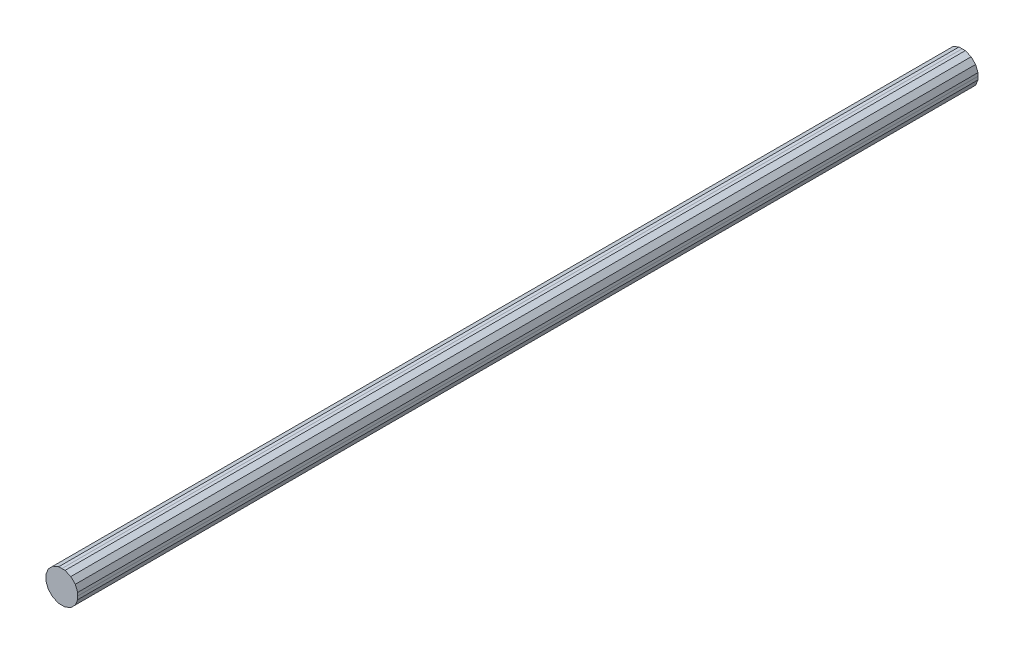
ISO-10303-21;
HEADER;
FILE_DESCRIPTION(('STEP AP214'),'2;1');
FILE_NAME('part.step','',(''),(''),'','','');
FILE_SCHEMA(('AUTOMOTIVE_DESIGN { 1 0 10303 214 1 1 1 1 }'));
ENDSEC;
DATA;
#1=APPLICATION_CONTEXT('core data for automotive mechanical design processes');
#2=APPLICATION_PROTOCOL_DEFINITION('international standard','automotive_design',2000,#1);
#3=PRODUCT_CONTEXT('',#1,'mechanical');
#4=PRODUCT('Part','Part','',(#3));
#5=PRODUCT_RELATED_PRODUCT_CATEGORY('part','',(#4));
#6=PRODUCT_DEFINITION_FORMATION('','',#4);
#7=PRODUCT_DEFINITION_CONTEXT('part definition',#1,'design');
#8=PRODUCT_DEFINITION('design','',#6,#7);
#9=PRODUCT_DEFINITION_SHAPE('','',#8);
#10=(LENGTH_UNIT() NAMED_UNIT(*) SI_UNIT(.MILLI.,.METRE.));
#11=(NAMED_UNIT(*) PLANE_ANGLE_UNIT() SI_UNIT($,.RADIAN.));
#12=(NAMED_UNIT(*) SI_UNIT($,.STERADIAN.) SOLID_ANGLE_UNIT());
#13=UNCERTAINTY_MEASURE_WITH_UNIT(LENGTH_MEASURE(1.E-05),#10,'distance_accuracy_value','');
#14=(GEOMETRIC_REPRESENTATION_CONTEXT(3) GLOBAL_UNCERTAINTY_ASSIGNED_CONTEXT((#13)) GLOBAL_UNIT_ASSIGNED_CONTEXT((#10,
#11,#12)) REPRESENTATION_CONTEXT('',''));
#15=CARTESIAN_POINT('',(0.,0.,0.));
#16=DIRECTION('',(0.,0.,1.));
#17=DIRECTION('',(1.,0.,0.));
#18=AXIS2_PLACEMENT_3D('',#15,#16,#17);
#19=CARTESIAN_POINT('',(0.,-0.2994914,16.99999902));
#20=DIRECTION('',(0.,0.,1.));
#21=DIRECTION('',(1.,0.,0.));
#22=AXIS2_PLACEMENT_3D('',#19,#20,#21);
#23=PLANE('',#22);
#24=DIRECTION('',(-1.,0.,0.));
#25=VECTOR('',#24,1.);
#26=CARTESIAN_POINT('',(0.05957062,-0.2994914,16.99999902));
#27=LINE('',#26,#25);
#28=CARTESIAN_POINT('',(0.05957062,-0.2994914,16.99999902));
#29=VERTEX_POINT('',#28);
#30=CARTESIAN_POINT('',(0.,-0.2994914,16.99999902));
#31=VERTEX_POINT('',#30);
#32=EDGE_CURVE('E27',#29,#31,#27,.T.);
#33=ORIENTED_EDGE('',*,*,#32,.F.);
#34=DIRECTION('',(-0.923885359866117,-0.382669363583048,0.));
#35=VECTOR('',#34,1.);
#36=CARTESIAN_POINT('',(0.1696466,-0.2538984,16.99999902));
#37=LINE('',#36,#35);
#38=CARTESIAN_POINT('',(0.1696466,-0.2538984,16.99999902));
#39=VERTEX_POINT('',#38);
#40=EDGE_CURVE('E403',#39,#29,#37,.T.);
#41=ORIENTED_EDGE('',*,*,#40,.F.);
#42=DIRECTION('',(-0.707106781187048,-0.707106781186048,0.));
#43=VECTOR('',#42,1.);
#44=CARTESIAN_POINT('',(0.25389586,-0.16964914,16.99999902));
#45=LINE('',#44,#43);
#46=CARTESIAN_POINT('',(0.25389586,-0.16964914,16.99999902));
#47=VERTEX_POINT('',#46);
#48=EDGE_CURVE('E305',#47,#39,#45,.T.);
#49=ORIENTED_EDGE('',*,*,#48,.F.);
#50=DIRECTION('',(-0.382687560176932,-0.923877822704835,0.));
#51=VECTOR('',#50,1.);
#52=CARTESIAN_POINT('',(0.2994914,-0.05957316000001,16.99999902));
#53=LINE('',#52,#51);
#54=CARTESIAN_POINT('',(0.2994914,-0.05957316000001,16.99999902));
#55=VERTEX_POINT('',#54);
#56=EDGE_CURVE('E124',#55,#47,#53,.T.);
#57=ORIENTED_EDGE('',*,*,#56,.F.);
#58=DIRECTION('',(0.,-1.,0.));
#59=VECTOR('',#58,1.);
#60=CARTESIAN_POINT('',(0.2994914,0.,16.99999902));
#61=LINE('',#60,#59);
#62=CARTESIAN_POINT('',(0.2994914,0.,16.99999902));
#63=VERTEX_POINT('',#62);
#64=EDGE_CURVE('E337',#63,#55,#61,.T.);
#65=ORIENTED_EDGE('',*,*,#64,.F.);
#66=DIRECTION('',(0.,-1.,0.));
#67=VECTOR('',#66,1.);
#68=CARTESIAN_POINT('',(0.2994914,0.05957061999999,16.99999902));
#69=LINE('',#68,#67);
#70=CARTESIAN_POINT('',(0.2994914,0.05957061999999,16.99999902));
#71=VERTEX_POINT('',#70);
#72=EDGE_CURVE('E279',#71,#63,#69,.T.);
#73=ORIENTED_EDGE('',*,*,#72,.F.);
#74=DIRECTION('',(0.382687560176932,-0.923877822704835,0.));
#75=VECTOR('',#74,1.);
#76=CARTESIAN_POINT('',(0.25389586,0.1696466,16.99999902));
#77=LINE('',#76,#75);
#78=CARTESIAN_POINT('',(0.25389586,0.1696466,16.99999902));
#79=VERTEX_POINT('',#78);
#80=EDGE_CURVE('E286',#79,#71,#77,.T.);
#81=ORIENTED_EDGE('',*,*,#80,.F.);
#82=DIRECTION('',(0.707106781186548,-0.707106781186548,0.));
#83=VECTOR('',#82,1.);
#84=CARTESIAN_POINT('',(0.1696466,0.25389586,16.99999902));
#85=LINE('',#84,#83);
#86=CARTESIAN_POINT('',(0.1696466,0.25389586,16.99999902));
#87=VERTEX_POINT('',#86);
#88=EDGE_CURVE('E310',#87,#79,#85,.T.);
#89=ORIENTED_EDGE('',*,*,#88,.F.);
#90=DIRECTION('',(0.923877822704835,-0.382687560176932,0.));
#91=VECTOR('',#90,1.);
#92=CARTESIAN_POINT('',(0.05957062,0.2994914,16.99999902));
#93=LINE('',#92,#91);
#94=CARTESIAN_POINT('',(0.05957062,0.2994914,16.99999902));
#95=VERTEX_POINT('',#94);
#96=EDGE_CURVE('E331',#95,#87,#93,.T.);
#97=ORIENTED_EDGE('',*,*,#96,.F.);
#98=DIRECTION('',(1.,0.,0.));
#99=VECTOR('',#98,1.);
#100=CARTESIAN_POINT('',(0.,0.2994914,16.99999902));
#101=LINE('',#100,#99);
#102=CARTESIAN_POINT('',(0.,0.2994914,16.99999902));
#103=VERTEX_POINT('',#102);
#104=EDGE_CURVE('E87',#103,#95,#101,.T.);
#105=ORIENTED_EDGE('',*,*,#104,.F.);
#106=DIRECTION('',(1.,0.,0.));
#107=VECTOR('',#106,1.);
#108=CARTESIAN_POINT('',(-0.05957316,0.2994914,16.99999902));
#109=LINE('',#108,#107);
#110=CARTESIAN_POINT('',(-0.05957316,0.2994914,16.99999902));
#111=VERTEX_POINT('',#110);
#112=EDGE_CURVE('E342',#111,#103,#109,.T.);
#113=ORIENTED_EDGE('',*,*,#112,.F.);
#114=DIRECTION('',(0.923877822704835,0.382687560176932,0.));
#115=VECTOR('',#114,1.);
#116=CARTESIAN_POINT('',(-0.16964914,0.25389586,16.99999902));
#117=LINE('',#116,#115);
#118=CARTESIAN_POINT('',(-0.16964914,0.25389586,16.99999902));
#119=VERTEX_POINT('',#118);
#120=EDGE_CURVE('E227',#119,#111,#117,.T.);
#121=ORIENTED_EDGE('',*,*,#120,.F.);
#122=DIRECTION('',(0.707106781186048,0.707106781187048,0.));
#123=VECTOR('',#122,1.);
#124=CARTESIAN_POINT('',(-0.2538984,0.1696466,16.99999902));
#125=LINE('',#124,#123);
#126=CARTESIAN_POINT('',(-0.2538984,0.1696466,16.99999902));
#127=VERTEX_POINT('',#126);
#128=EDGE_CURVE('E221',#127,#119,#125,.T.);
#129=ORIENTED_EDGE('',*,*,#128,.F.);
#130=DIRECTION('',(0.382669363583048,0.923885359866117,0.));
#131=VECTOR('',#130,1.);
#132=CARTESIAN_POINT('',(-0.2994914,0.05957061999999,16.99999902));
#133=LINE('',#132,#131);
#134=CARTESIAN_POINT('',(-0.2994914,0.05957061999999,16.99999902));
#135=VERTEX_POINT('',#134);
#136=EDGE_CURVE('E224',#135,#127,#133,.T.);
#137=ORIENTED_EDGE('',*,*,#136,.F.);
#138=DIRECTION('',(0.,1.,0.));
#139=VECTOR('',#138,1.);
#140=CARTESIAN_POINT('',(-0.2994914,0.,16.99999902));
#141=LINE('',#140,#139);
#142=CARTESIAN_POINT('',(-0.2994914,0.,16.99999902));
#143=VERTEX_POINT('',#142);
#144=EDGE_CURVE('E260',#143,#135,#141,.T.);
#145=ORIENTED_EDGE('',*,*,#144,.F.);
#146=DIRECTION('',(0.,1.,0.));
#147=VECTOR('',#146,1.);
#148=CARTESIAN_POINT('',(-0.2994914,-0.05957316000001,16.99999902));
#149=LINE('',#148,#147);
#150=CARTESIAN_POINT('',(-0.2994914,-0.05957316000001,16.99999902));
#151=VERTEX_POINT('',#150);
#152=EDGE_CURVE('E183',#151,#143,#149,.T.);
#153=ORIENTED_EDGE('',*,*,#152,.F.);
#154=DIRECTION('',(-0.382669363583048,0.923885359866117,0.));
#155=VECTOR('',#154,1.);
#156=CARTESIAN_POINT('',(-0.2538984,-0.16964914,16.99999902));
#157=LINE('',#156,#155);
#158=CARTESIAN_POINT('',(-0.2538984,-0.16964914,16.99999902));
#159=VERTEX_POINT('',#158);
#160=EDGE_CURVE('E349',#159,#151,#157,.T.);
#161=ORIENTED_EDGE('',*,*,#160,.F.);
#162=DIRECTION('',(-0.707106781186548,0.707106781186548,0.));
#163=VECTOR('',#162,1.);
#164=CARTESIAN_POINT('',(-0.16964914,-0.2538984,16.99999902));
#165=LINE('',#164,#163);
#166=CARTESIAN_POINT('',(-0.16964914,-0.2538984,16.99999902));
#167=VERTEX_POINT('',#166);
#168=EDGE_CURVE('E296',#167,#159,#165,.T.);
#169=ORIENTED_EDGE('',*,*,#168,.F.);
#170=DIRECTION('',(-0.923885359866117,0.382669363583048,0.));
#171=VECTOR('',#170,1.);
#172=CARTESIAN_POINT('',(-0.05957316,-0.2994914,16.99999902));
#173=LINE('',#172,#171);
#174=CARTESIAN_POINT('',(-0.05957316,-0.2994914,16.99999902));
#175=VERTEX_POINT('',#174);
#176=EDGE_CURVE('E323',#175,#167,#173,.T.);
#177=ORIENTED_EDGE('',*,*,#176,.F.);
#178=DIRECTION('',(-1.,0.,0.));
#179=VECTOR('',#178,1.);
#180=CARTESIAN_POINT('',(0.,-0.2994914,16.99999902));
#181=LINE('',#180,#179);
#182=EDGE_CURVE('E271',#31,#175,#181,.T.);
#183=ORIENTED_EDGE('',*,*,#182,.F.);
#184=EDGE_LOOP('',(#33,#41,#49,#57,#65,#73,#81,#89,#97,#105,#113,#121,#129,#137,#145,#153,#161,
#169,#177,#183));
#185=FACE_BOUND('',#184,.T.);
#186=ADVANCED_FACE('F16',(#185),#23,.T.);
#187=CARTESIAN_POINT('',(0.,-0.2994914,0.));
#188=DIRECTION('',(0.,0.,1.));
#189=DIRECTION('',(1.,0.,0.));
#190=AXIS2_PLACEMENT_3D('',#187,#188,#189);
#191=PLANE('',#190);
#192=DIRECTION('',(-1.,0.,0.));
#193=VECTOR('',#192,1.);
#194=CARTESIAN_POINT('',(0.,-0.2994914,0.));
#195=LINE('',#194,#193);
#196=CARTESIAN_POINT('',(0.,-0.2994914,0.));
#197=VERTEX_POINT('',#196);
#198=CARTESIAN_POINT('',(-0.05957316,-0.2994914,0.));
#199=VERTEX_POINT('',#198);
#200=EDGE_CURVE('E419',#197,#199,#195,.T.);
#201=ORIENTED_EDGE('',*,*,#200,.T.);
#202=DIRECTION('',(-0.923885359866117,0.382669363583048,0.));
#203=VECTOR('',#202,1.);
#204=CARTESIAN_POINT('',(-0.05957316,-0.2994914,0.));
#205=LINE('',#204,#203);
#206=CARTESIAN_POINT('',(-0.16964914,-0.2538984,0.));
#207=VERTEX_POINT('',#206);
#208=EDGE_CURVE('E318',#199,#207,#205,.T.);
#209=ORIENTED_EDGE('',*,*,#208,.T.);
#210=DIRECTION('',(-0.707106781186548,0.707106781186548,0.));
#211=VECTOR('',#210,1.);
#212=CARTESIAN_POINT('',(-0.16964914,-0.2538984,0.));
#213=LINE('',#212,#211);
#214=CARTESIAN_POINT('',(-0.2538984,-0.16964914,0.));
#215=VERTEX_POINT('',#214);
#216=EDGE_CURVE('E295',#207,#215,#213,.T.);
#217=ORIENTED_EDGE('',*,*,#216,.T.);
#218=DIRECTION('',(-0.382669363583048,0.923885359866117,0.));
#219=VECTOR('',#218,1.);
#220=CARTESIAN_POINT('',(-0.2538984,-0.16964914,0.));
#221=LINE('',#220,#219);
#222=CARTESIAN_POINT('',(-0.2994914,-0.05957316000001,0.));
#223=VERTEX_POINT('',#222);
#224=EDGE_CURVE('E327',#215,#223,#221,.T.);
#225=ORIENTED_EDGE('',*,*,#224,.T.);
#226=DIRECTION('',(0.,1.,0.));
#227=VECTOR('',#226,1.);
#228=CARTESIAN_POINT('',(-0.2994914,-0.05957316000001,0.));
#229=LINE('',#228,#227);
#230=CARTESIAN_POINT('',(-0.2994914,0.,0.));
#231=VERTEX_POINT('',#230);
#232=EDGE_CURVE('E194',#223,#231,#229,.T.);
#233=ORIENTED_EDGE('',*,*,#232,.T.);
#234=DIRECTION('',(0.,1.,0.));
#235=VECTOR('',#234,1.);
#236=CARTESIAN_POINT('',(-0.2994914,0.,0.));
#237=LINE('',#236,#235);
#238=CARTESIAN_POINT('',(-0.2994914,0.05957061999999,0.));
#239=VERTEX_POINT('',#238);
#240=EDGE_CURVE('E249',#231,#239,#237,.T.);
#241=ORIENTED_EDGE('',*,*,#240,.T.);
#242=DIRECTION('',(0.382669363583048,0.923885359866117,0.));
#243=VECTOR('',#242,1.);
#244=CARTESIAN_POINT('',(-0.2994914,0.05957061999999,0.));
#245=LINE('',#244,#243);
#246=CARTESIAN_POINT('',(-0.2538984,0.1696466,0.));
#247=VERTEX_POINT('',#246);
#248=EDGE_CURVE('E233',#239,#247,#245,.T.);
#249=ORIENTED_EDGE('',*,*,#248,.T.);
#250=DIRECTION('',(0.707106781186048,0.707106781187048,0.));
#251=VECTOR('',#250,1.);
#252=CARTESIAN_POINT('',(-0.2538984,0.1696466,0.));
#253=LINE('',#252,#251);
#254=CARTESIAN_POINT('',(-0.16964914,0.25389586,0.));
#255=VERTEX_POINT('',#254);
#256=EDGE_CURVE('E239',#247,#255,#253,.T.);
#257=ORIENTED_EDGE('',*,*,#256,.T.);
#258=DIRECTION('',(0.923877822704835,0.382687560176932,0.));
#259=VECTOR('',#258,1.);
#260=CARTESIAN_POINT('',(-0.16964914,0.25389586,0.));
#261=LINE('',#260,#259);
#262=CARTESIAN_POINT('',(-0.05957316,0.2994914,0.));
#263=VERTEX_POINT('',#262);
#264=EDGE_CURVE('E346',#255,#263,#261,.T.);
#265=ORIENTED_EDGE('',*,*,#264,.T.);
#266=DIRECTION('',(1.,0.,0.));
#267=VECTOR('',#266,1.);
#268=CARTESIAN_POINT('',(-0.05957316,0.2994914,0.));
#269=LINE('',#268,#267);
#270=CARTESIAN_POINT('',(0.,0.2994914,0.));
#271=VERTEX_POINT('',#270);
#272=EDGE_CURVE('E20',#263,#271,#269,.T.);
#273=ORIENTED_EDGE('',*,*,#272,.T.);
#274=DIRECTION('',(1.,0.,0.));
#275=VECTOR('',#274,1.);
#276=CARTESIAN_POINT('',(0.,0.2994914,0.));
#277=LINE('',#276,#275);
#278=CARTESIAN_POINT('',(0.05957062,0.2994914,0.));
#279=VERTEX_POINT('',#278);
#280=EDGE_CURVE('E336',#271,#279,#277,.T.);
#281=ORIENTED_EDGE('',*,*,#280,.T.);
#282=DIRECTION('',(0.923877822704835,-0.382687560176932,0.));
#283=VECTOR('',#282,1.);
#284=CARTESIAN_POINT('',(0.05957062,0.2994914,0.));
#285=LINE('',#284,#283);
#286=CARTESIAN_POINT('',(0.1696466,0.25389586,0.));
#287=VERTEX_POINT('',#286);
#288=EDGE_CURVE('E314',#279,#287,#285,.T.);
#289=ORIENTED_EDGE('',*,*,#288,.T.);
#290=DIRECTION('',(0.707106781186548,-0.707106781186548,0.));
#291=VECTOR('',#290,1.);
#292=CARTESIAN_POINT('',(0.1696466,0.25389586,0.));
#293=LINE('',#292,#291);
#294=CARTESIAN_POINT('',(0.25389586,0.1696466,0.));
#295=VERTEX_POINT('',#294);
#296=EDGE_CURVE('E282',#287,#295,#293,.T.);
#297=ORIENTED_EDGE('',*,*,#296,.T.);
#298=DIRECTION('',(0.382687560176932,-0.923877822704835,0.));
#299=VECTOR('',#298,1.);
#300=CARTESIAN_POINT('',(0.25389586,0.1696466,0.));
#301=LINE('',#300,#299);
#302=CARTESIAN_POINT('',(0.2994914,0.05957061999999,0.));
#303=VERTEX_POINT('',#302);
#304=EDGE_CURVE('E291',#295,#303,#301,.T.);
#305=ORIENTED_EDGE('',*,*,#304,.T.);
#306=DIRECTION('',(0.,-1.,0.));
#307=VECTOR('',#306,1.);
#308=CARTESIAN_POINT('',(0.2994914,0.05957061999999,0.));
#309=LINE('',#308,#307);
#310=CARTESIAN_POINT('',(0.2994914,0.,0.));
#311=VERTEX_POINT('',#310);
#312=EDGE_CURVE('E278',#303,#311,#309,.T.);
#313=ORIENTED_EDGE('',*,*,#312,.T.);
#314=DIRECTION('',(0.,-1.,0.));
#315=VECTOR('',#314,1.);
#316=CARTESIAN_POINT('',(0.2994914,0.,0.));
#317=LINE('',#316,#315);
#318=CARTESIAN_POINT('',(0.2994914,-0.05957316000001,0.));
#319=VERTEX_POINT('',#318);
#320=EDGE_CURVE('E113',#311,#319,#317,.T.);
#321=ORIENTED_EDGE('',*,*,#320,.T.);
#322=DIRECTION('',(-0.382687560176932,-0.923877822704835,0.));
#323=VECTOR('',#322,1.);
#324=CARTESIAN_POINT('',(0.2994914,-0.05957316000001,0.));
#325=LINE('',#324,#323);
#326=CARTESIAN_POINT('',(0.25389586,-0.16964914,0.));
#327=VERTEX_POINT('',#326);
#328=EDGE_CURVE('E301',#319,#327,#325,.T.);
#329=ORIENTED_EDGE('',*,*,#328,.T.);
#330=DIRECTION('',(-0.707106781187048,-0.707106781186048,0.));
#331=VECTOR('',#330,1.);
#332=CARTESIAN_POINT('',(0.25389586,-0.16964914,0.));
#333=LINE('',#332,#331);
#334=CARTESIAN_POINT('',(0.1696466,-0.2538984,0.));
#335=VERTEX_POINT('',#334);
#336=EDGE_CURVE('E399',#327,#335,#333,.T.);
#337=ORIENTED_EDGE('',*,*,#336,.T.);
#338=DIRECTION('',(-0.923885359866117,-0.382669363583048,0.));
#339=VECTOR('',#338,1.);
#340=CARTESIAN_POINT('',(0.1696466,-0.2538984,0.));
#341=LINE('',#340,#339);
#342=CARTESIAN_POINT('',(0.05957062,-0.2994914,0.));
#343=VERTEX_POINT('',#342);
#344=EDGE_CURVE('E263',#335,#343,#341,.T.);
#345=ORIENTED_EDGE('',*,*,#344,.T.);
#346=DIRECTION('',(-1.,0.,0.));
#347=VECTOR('',#346,1.);
#348=CARTESIAN_POINT('',(0.05957062,-0.2994914,0.));
#349=LINE('',#348,#347);
#350=EDGE_CURVE('E10',#343,#197,#349,.T.);
#351=ORIENTED_EDGE('',*,*,#350,.T.);
#352=EDGE_LOOP('',(#201,#209,#217,#225,#233,#241,#249,#257,#265,#273,#281,#289,#297,#305,#313,
#321,#329,#337,#345,#351));
#353=FACE_BOUND('',#352,.T.);
#354=ADVANCED_FACE('F465',(#353),#191,.F.);
#355=CARTESIAN_POINT('',(0.05957062,-0.2994914,0.));
#356=DIRECTION('',(0.,-1.,0.));
#357=DIRECTION('',(0.,0.,-1.));
#358=AXIS2_PLACEMENT_3D('',#355,#356,#357);
#359=PLANE('',#358);
#360=DIRECTION('',(0.,0.,1.));
#361=VECTOR('',#360,1.);
#362=CARTESIAN_POINT('',(0.05957062,-0.2994914,0.));
#363=LINE('',#362,#361);
#364=EDGE_CURVE('E266',#343,#29,#363,.T.);
#365=ORIENTED_EDGE('',*,*,#364,.T.);
#366=ORIENTED_EDGE('',*,*,#32,.T.);
#367=DIRECTION('',(0.,0.,1.));
#368=VECTOR('',#367,1.);
#369=CARTESIAN_POINT('',(0.,-0.2994914,0.));
#370=LINE('',#369,#368);
#371=EDGE_CURVE('E267',#197,#31,#370,.T.);
#372=ORIENTED_EDGE('',*,*,#371,.F.);
#373=ORIENTED_EDGE('',*,*,#350,.F.);
#374=EDGE_LOOP('',(#365,#366,#372,#373));
#375=FACE_BOUND('',#374,.T.);
#376=ADVANCED_FACE('F790',(#375),#359,.T.);
#377=CARTESIAN_POINT('',(0.1696466,-0.2538984,0.));
#378=DIRECTION('',(0.382669363583048,-0.923885359866117,0.));
#379=DIRECTION('',(0.,0.,-1.));
#380=AXIS2_PLACEMENT_3D('',#377,#378,#379);
#381=PLANE('',#380);
#382=DIRECTION('',(0.,0.,1.));
#383=VECTOR('',#382,1.);
#384=CARTESIAN_POINT('',(0.1696466,-0.2538984,0.));
#385=LINE('',#384,#383);
#386=EDGE_CURVE('E379',#335,#39,#385,.T.);
#387=ORIENTED_EDGE('',*,*,#386,.T.);
#388=ORIENTED_EDGE('',*,*,#40,.T.);
#389=ORIENTED_EDGE('',*,*,#364,.F.);
#390=ORIENTED_EDGE('',*,*,#344,.F.);
#391=EDGE_LOOP('',(#387,#388,#389,#390));
#392=FACE_BOUND('',#391,.T.);
#393=ADVANCED_FACE('F18',(#392),#381,.T.);
#394=CARTESIAN_POINT('',(0.25389586,-0.16964914,0.));
#395=DIRECTION('',(0.707106781186048,-0.707106781187048,0.));
#396=DIRECTION('',(0.,0.,-1.));
#397=AXIS2_PLACEMENT_3D('',#394,#395,#396);
#398=PLANE('',#397);
#399=DIRECTION('',(0.,0.,1.));
#400=VECTOR('',#399,1.);
#401=CARTESIAN_POINT('',(0.25389586,-0.16964914,0.));
#402=LINE('',#401,#400);
#403=EDGE_CURVE('E274',#327,#47,#402,.T.);
#404=ORIENTED_EDGE('',*,*,#403,.T.);
#405=ORIENTED_EDGE('',*,*,#48,.T.);
#406=ORIENTED_EDGE('',*,*,#386,.F.);
#407=ORIENTED_EDGE('',*,*,#336,.F.);
#408=EDGE_LOOP('',(#404,#405,#406,#407));
#409=FACE_BOUND('',#408,.T.);
#410=ADVANCED_FACE('F770',(#409),#398,.T.);
#411=CARTESIAN_POINT('',(0.2994914,-0.05957316000001,0.));
#412=DIRECTION('',(0.923877822704835,-0.382687560176932,0.));
#413=DIRECTION('',(0.,0.,-1.));
#414=AXIS2_PLACEMENT_3D('',#411,#412,#413);
#415=PLANE('',#414);
#416=DIRECTION('',(0.,0.,1.));
#417=VECTOR('',#416,1.);
#418=CARTESIAN_POINT('',(0.2994914,-0.05957316000001,0.));
#419=LINE('',#418,#417);
#420=EDGE_CURVE('E341',#319,#55,#419,.T.);
#421=ORIENTED_EDGE('',*,*,#420,.T.);
#422=ORIENTED_EDGE('',*,*,#56,.T.);
#423=ORIENTED_EDGE('',*,*,#403,.F.);
#424=ORIENTED_EDGE('',*,*,#328,.F.);
#425=EDGE_LOOP('',(#421,#422,#423,#424));
#426=FACE_BOUND('',#425,.T.);
#427=ADVANCED_FACE('F761',(#426),#415,.T.);
#428=CARTESIAN_POINT('',(0.2994914,0.,0.));
#429=DIRECTION('',(1.,0.,0.));
#430=DIRECTION('',(0.,1.,0.));
#431=AXIS2_PLACEMENT_3D('',#428,#429,#430);
#432=PLANE('',#431);
#433=DIRECTION('',(0.,0.,1.));
#434=VECTOR('',#433,1.);
#435=CARTESIAN_POINT('',(0.2994914,0.,0.));
#436=LINE('',#435,#434);
#437=EDGE_CURVE('E275',#311,#63,#436,.T.);
#438=ORIENTED_EDGE('',*,*,#437,.T.);
#439=ORIENTED_EDGE('',*,*,#64,.T.);
#440=ORIENTED_EDGE('',*,*,#420,.F.);
#441=ORIENTED_EDGE('',*,*,#320,.F.);
#442=EDGE_LOOP('',(#438,#439,#440,#441));
#443=FACE_BOUND('',#442,.T.);
#444=ADVANCED_FACE('F752',(#443),#432,.T.);
#445=CARTESIAN_POINT('',(0.2994914,0.05957061999999,0.));
#446=DIRECTION('',(1.,0.,0.));
#447=DIRECTION('',(0.,1.,0.));
#448=AXIS2_PLACEMENT_3D('',#445,#446,#447);
#449=PLANE('',#448);
#450=DIRECTION('',(0.,0.,1.));
#451=VECTOR('',#450,1.);
#452=CARTESIAN_POINT('',(0.2994914,0.05957061999999,0.));
#453=LINE('',#452,#451);
#454=EDGE_CURVE('E366',#303,#71,#453,.T.);
#455=ORIENTED_EDGE('',*,*,#454,.T.);
#456=ORIENTED_EDGE('',*,*,#72,.T.);
#457=ORIENTED_EDGE('',*,*,#437,.F.);
#458=ORIENTED_EDGE('',*,*,#312,.F.);
#459=EDGE_LOOP('',(#455,#456,#457,#458));
#460=FACE_BOUND('',#459,.T.);
#461=ADVANCED_FACE('F464',(#460),#449,.T.);
#462=CARTESIAN_POINT('',(0.25389586,0.1696466,0.));
#463=DIRECTION('',(0.923877822704835,0.382687560176932,0.));
#464=DIRECTION('',(0.,0.,-1.));
#465=AXIS2_PLACEMENT_3D('',#462,#463,#464);
#466=PLANE('',#465);
#467=DIRECTION('',(0.,0.,1.));
#468=VECTOR('',#467,1.);
#469=CARTESIAN_POINT('',(0.25389586,0.1696466,0.));
#470=LINE('',#469,#468);
#471=EDGE_CURVE('E287',#295,#79,#470,.T.);
#472=ORIENTED_EDGE('',*,*,#471,.T.);
#473=ORIENTED_EDGE('',*,*,#80,.T.);
#474=ORIENTED_EDGE('',*,*,#454,.F.);
#475=ORIENTED_EDGE('',*,*,#304,.F.);
#476=EDGE_LOOP('',(#472,#473,#474,#475));
#477=FACE_BOUND('',#476,.T.);
#478=ADVANCED_FACE('F455',(#477),#466,.T.);
#479=CARTESIAN_POINT('',(0.1696466,0.25389586,0.));
#480=DIRECTION('',(0.707106781186548,0.707106781186548,0.));
#481=DIRECTION('',(0.,0.,-1.));
#482=AXIS2_PLACEMENT_3D('',#479,#480,#481);
#483=PLANE('',#482);
#484=DIRECTION('',(0.,0.,1.));
#485=VECTOR('',#484,1.);
#486=CARTESIAN_POINT('',(0.1696466,0.25389586,0.));
#487=LINE('',#486,#485);
#488=EDGE_CURVE('E335',#287,#87,#487,.T.);
#489=ORIENTED_EDGE('',*,*,#488,.T.);
#490=ORIENTED_EDGE('',*,*,#88,.T.);
#491=ORIENTED_EDGE('',*,*,#471,.F.);
#492=ORIENTED_EDGE('',*,*,#296,.F.);
#493=EDGE_LOOP('',(#489,#490,#491,#492));
#494=FACE_BOUND('',#493,.T.);
#495=ADVANCED_FACE('F459',(#494),#483,.T.);
#496=CARTESIAN_POINT('',(0.05957062,0.2994914,0.));
#497=DIRECTION('',(0.382687560176932,0.923877822704835,0.));
#498=DIRECTION('',(0.,0.,-1.));
#499=AXIS2_PLACEMENT_3D('',#496,#497,#498);
#500=PLANE('',#499);
#501=DIRECTION('',(0.,0.,1.));
#502=VECTOR('',#501,1.);
#503=CARTESIAN_POINT('',(0.05957062,0.2994914,0.));
#504=LINE('',#503,#502);
#505=EDGE_CURVE('E300',#279,#95,#504,.T.);
#506=ORIENTED_EDGE('',*,*,#505,.T.);
#507=ORIENTED_EDGE('',*,*,#96,.T.);
#508=ORIENTED_EDGE('',*,*,#488,.F.);
#509=ORIENTED_EDGE('',*,*,#288,.F.);
#510=EDGE_LOOP('',(#506,#507,#508,#509));
#511=FACE_BOUND('',#510,.T.);
#512=ADVANCED_FACE('F469',(#511),#500,.T.);
#513=CARTESIAN_POINT('',(0.,0.2994914,0.));
#514=DIRECTION('',(0.,1.,0.));
#515=DIRECTION('',(1.,0.,0.));
#516=AXIS2_PLACEMENT_3D('',#513,#514,#515);
#517=PLANE('',#516);
#518=DIRECTION('',(0.,0.,1.));
#519=VECTOR('',#518,1.);
#520=CARTESIAN_POINT('',(0.,0.2994914,0.));
#521=LINE('',#520,#519);
#522=EDGE_CURVE('E345',#271,#103,#521,.T.);
#523=ORIENTED_EDGE('',*,*,#522,.T.);
#524=ORIENTED_EDGE('',*,*,#104,.T.);
#525=ORIENTED_EDGE('',*,*,#505,.F.);
#526=ORIENTED_EDGE('',*,*,#280,.F.);
#527=EDGE_LOOP('',(#523,#524,#525,#526));
#528=FACE_BOUND('',#527,.T.);
#529=ADVANCED_FACE('F471',(#528),#517,.T.);
#530=CARTESIAN_POINT('',(-0.05957316,0.2994914,0.));
#531=DIRECTION('',(0.,1.,0.));
#532=DIRECTION('',(1.,0.,0.));
#533=AXIS2_PLACEMENT_3D('',#530,#531,#532);
#534=PLANE('',#533);
#535=DIRECTION('',(0.,0.,1.));
#536=VECTOR('',#535,1.);
#537=CARTESIAN_POINT('',(-0.05957316,0.2994914,0.));
#538=LINE('',#537,#536);
#539=EDGE_CURVE('E382',#263,#111,#538,.T.);
#540=ORIENTED_EDGE('',*,*,#539,.T.);
#541=ORIENTED_EDGE('',*,*,#112,.T.);
#542=ORIENTED_EDGE('',*,*,#522,.F.);
#543=ORIENTED_EDGE('',*,*,#272,.F.);
#544=EDGE_LOOP('',(#540,#541,#542,#543));
#545=FACE_BOUND('',#544,.T.);
#546=ADVANCED_FACE('F472',(#545),#534,.T.);
#547=CARTESIAN_POINT('',(-0.16964914,0.25389586,0.));
#548=DIRECTION('',(-0.382687560176932,0.923877822704835,0.));
#549=DIRECTION('',(0.,0.,1.));
#550=AXIS2_PLACEMENT_3D('',#547,#548,#549);
#551=PLANE('',#550);
#552=DIRECTION('',(0.,0.,1.));
#553=VECTOR('',#552,1.);
#554=CARTESIAN_POINT('',(-0.16964914,0.25389586,0.));
#555=LINE('',#554,#553);
#556=EDGE_CURVE('E232',#255,#119,#555,.T.);
#557=ORIENTED_EDGE('',*,*,#556,.T.);
#558=ORIENTED_EDGE('',*,*,#120,.T.);
#559=ORIENTED_EDGE('',*,*,#539,.F.);
#560=ORIENTED_EDGE('',*,*,#264,.F.);
#561=EDGE_LOOP('',(#557,#558,#559,#560));
#562=FACE_BOUND('',#561,.T.);
#563=ADVANCED_FACE('F473',(#562),#551,.T.);
#564=CARTESIAN_POINT('',(-0.2538984,0.1696466,0.));
#565=DIRECTION('',(-0.707106781187048,0.707106781186048,0.));
#566=DIRECTION('',(0.,0.,1.));
#567=AXIS2_PLACEMENT_3D('',#564,#565,#566);
#568=PLANE('',#567);
#569=DIRECTION('',(0.,0.,1.));
#570=VECTOR('',#569,1.);
#571=CARTESIAN_POINT('',(-0.2538984,0.1696466,0.));
#572=LINE('',#571,#570);
#573=EDGE_CURVE('E236',#247,#127,#572,.T.);
#574=ORIENTED_EDGE('',*,*,#573,.T.);
#575=ORIENTED_EDGE('',*,*,#128,.T.);
#576=ORIENTED_EDGE('',*,*,#556,.F.);
#577=ORIENTED_EDGE('',*,*,#256,.F.);
#578=EDGE_LOOP('',(#574,#575,#576,#577));
#579=FACE_BOUND('',#578,.T.);
#580=ADVANCED_FACE('F237',(#579),#568,.T.);
#581=CARTESIAN_POINT('',(-0.2994914,0.05957061999999,0.));
#582=DIRECTION('',(-0.923885359866117,0.382669363583048,0.));
#583=DIRECTION('',(0.,0.,1.));
#584=AXIS2_PLACEMENT_3D('',#581,#582,#583);
#585=PLANE('',#584);
#586=DIRECTION('',(0.,0.,1.));
#587=VECTOR('',#586,1.);
#588=CARTESIAN_POINT('',(-0.2994914,0.05957061999999,0.));
#589=LINE('',#588,#587);
#590=EDGE_CURVE('E246',#239,#135,#589,.T.);
#591=ORIENTED_EDGE('',*,*,#590,.T.);
#592=ORIENTED_EDGE('',*,*,#136,.T.);
#593=ORIENTED_EDGE('',*,*,#573,.F.);
#594=ORIENTED_EDGE('',*,*,#248,.F.);
#595=EDGE_LOOP('',(#591,#592,#593,#594));
#596=FACE_BOUND('',#595,.T.);
#597=ADVANCED_FACE('F244',(#596),#585,.T.);
#598=CARTESIAN_POINT('',(-0.2994914,0.,0.));
#599=DIRECTION('',(-1.,0.,0.));
#600=DIRECTION('',(0.,0.,1.));
#601=AXIS2_PLACEMENT_3D('',#598,#599,#600);
#602=PLANE('',#601);
#603=DIRECTION('',(0.,0.,1.));
#604=VECTOR('',#603,1.);
#605=CARTESIAN_POINT('',(-0.2994914,0.,0.));
#606=LINE('',#605,#604);
#607=EDGE_CURVE('E306',#231,#143,#606,.T.);
#608=ORIENTED_EDGE('',*,*,#607,.T.);
#609=ORIENTED_EDGE('',*,*,#144,.T.);
#610=ORIENTED_EDGE('',*,*,#590,.F.);
#611=ORIENTED_EDGE('',*,*,#240,.F.);
#612=EDGE_LOOP('',(#608,#609,#610,#611));
#613=FACE_BOUND('',#612,.T.);
#614=ADVANCED_FACE('F662',(#613),#602,.T.);
#615=CARTESIAN_POINT('',(-0.2994914,-0.05957316000001,0.));
#616=DIRECTION('',(-1.,0.,0.));
#617=DIRECTION('',(0.,0.,1.));
#618=AXIS2_PLACEMENT_3D('',#615,#616,#617);
#619=PLANE('',#618);
#620=DIRECTION('',(0.,0.,1.));
#621=VECTOR('',#620,1.);
#622=CARTESIAN_POINT('',(-0.2994914,-0.05957316000001,0.));
#623=LINE('',#622,#621);
#624=EDGE_CURVE('E330',#223,#151,#623,.T.);
#625=ORIENTED_EDGE('',*,*,#624,.T.);
#626=ORIENTED_EDGE('',*,*,#152,.T.);
#627=ORIENTED_EDGE('',*,*,#607,.F.);
#628=ORIENTED_EDGE('',*,*,#232,.F.);
#629=EDGE_LOOP('',(#625,#626,#627,#628));
#630=FACE_BOUND('',#629,.T.);
#631=ADVANCED_FACE('F652',(#630),#619,.T.);
#632=CARTESIAN_POINT('',(-0.2538984,-0.16964914,0.));
#633=DIRECTION('',(-0.923885359866117,-0.382669363583048,0.));
#634=DIRECTION('',(-0.382669363583048,0.923885359866117,0.));
#635=AXIS2_PLACEMENT_3D('',#632,#633,#634);
#636=PLANE('',#635);
#637=DIRECTION('',(0.,0.,1.));
#638=VECTOR('',#637,1.);
#639=CARTESIAN_POINT('',(-0.2538984,-0.16964914,0.));
#640=LINE('',#639,#638);
#641=EDGE_CURVE('E292',#215,#159,#640,.T.);
#642=ORIENTED_EDGE('',*,*,#641,.T.);
#643=ORIENTED_EDGE('',*,*,#160,.T.);
#644=ORIENTED_EDGE('',*,*,#624,.F.);
#645=ORIENTED_EDGE('',*,*,#224,.F.);
#646=EDGE_LOOP('',(#642,#643,#644,#645));
#647=FACE_BOUND('',#646,.T.);
#648=ADVANCED_FACE('F640',(#647),#636,.T.);
#649=CARTESIAN_POINT('',(-0.16964914,-0.2538984,0.));
#650=DIRECTION('',(-0.707106781186548,-0.707106781186548,0.));
#651=DIRECTION('',(-0.707106781186548,0.707106781186548,0.));
#652=AXIS2_PLACEMENT_3D('',#649,#650,#651);
#653=PLANE('',#652);
#654=DIRECTION('',(0.,0.,1.));
#655=VECTOR('',#654,1.);
#656=CARTESIAN_POINT('',(-0.16964914,-0.2538984,0.));
#657=LINE('',#656,#655);
#658=EDGE_CURVE('E319',#207,#167,#657,.T.);
#659=ORIENTED_EDGE('',*,*,#658,.T.);
#660=ORIENTED_EDGE('',*,*,#168,.T.);
#661=ORIENTED_EDGE('',*,*,#641,.F.);
#662=ORIENTED_EDGE('',*,*,#216,.F.);
#663=EDGE_LOOP('',(#659,#660,#661,#662));
#664=FACE_BOUND('',#663,.T.);
#665=ADVANCED_FACE('F627',(#664),#653,.T.);
#666=CARTESIAN_POINT('',(-0.05957316,-0.2994914,0.));
#667=DIRECTION('',(-0.382669363583048,-0.923885359866117,0.));
#668=DIRECTION('',(-0.923885359866117,0.382669363583048,0.));
#669=AXIS2_PLACEMENT_3D('',#666,#667,#668);
#670=PLANE('',#669);
#671=DIRECTION('',(0.,0.,1.));
#672=VECTOR('',#671,1.);
#673=CARTESIAN_POINT('',(-0.05957316,-0.2994914,0.));
#674=LINE('',#673,#672);
#675=EDGE_CURVE('E373',#199,#175,#674,.T.);
#676=ORIENTED_EDGE('',*,*,#675,.T.);
#677=ORIENTED_EDGE('',*,*,#176,.T.);
#678=ORIENTED_EDGE('',*,*,#658,.F.);
#679=ORIENTED_EDGE('',*,*,#208,.F.);
#680=EDGE_LOOP('',(#676,#677,#678,#679));
#681=FACE_BOUND('',#680,.T.);
#682=ADVANCED_FACE('F613',(#681),#670,.T.);
#683=CARTESIAN_POINT('',(0.,-0.2994914,0.));
#684=DIRECTION('',(0.,-1.,0.));
#685=DIRECTION('',(0.,0.,-1.));
#686=AXIS2_PLACEMENT_3D('',#683,#684,#685);
#687=PLANE('',#686);
#688=ORIENTED_EDGE('',*,*,#371,.T.);
#689=ORIENTED_EDGE('',*,*,#182,.T.);
#690=ORIENTED_EDGE('',*,*,#675,.F.);
#691=ORIENTED_EDGE('',*,*,#200,.F.);
#692=EDGE_LOOP('',(#688,#689,#690,#691));
#693=FACE_BOUND('',#692,.T.);
#694=ADVANCED_FACE('F607',(#693),#687,.T.);
#695=CLOSED_SHELL('',(#186,#354,#376,#393,#410,#427,#444,#461,#478,#495,#512,#529,#546,#563,
#580,#597,#614,#631,#648,#665,#682,#694));
#696=MANIFOLD_SOLID_BREP('B1',#695);
#697=ADVANCED_BREP_SHAPE_REPRESENTATION('',(#18,#696),#14);
#698=SHAPE_DEFINITION_REPRESENTATION(#9,#697);
ENDSEC;
END-ISO-10303-21;
